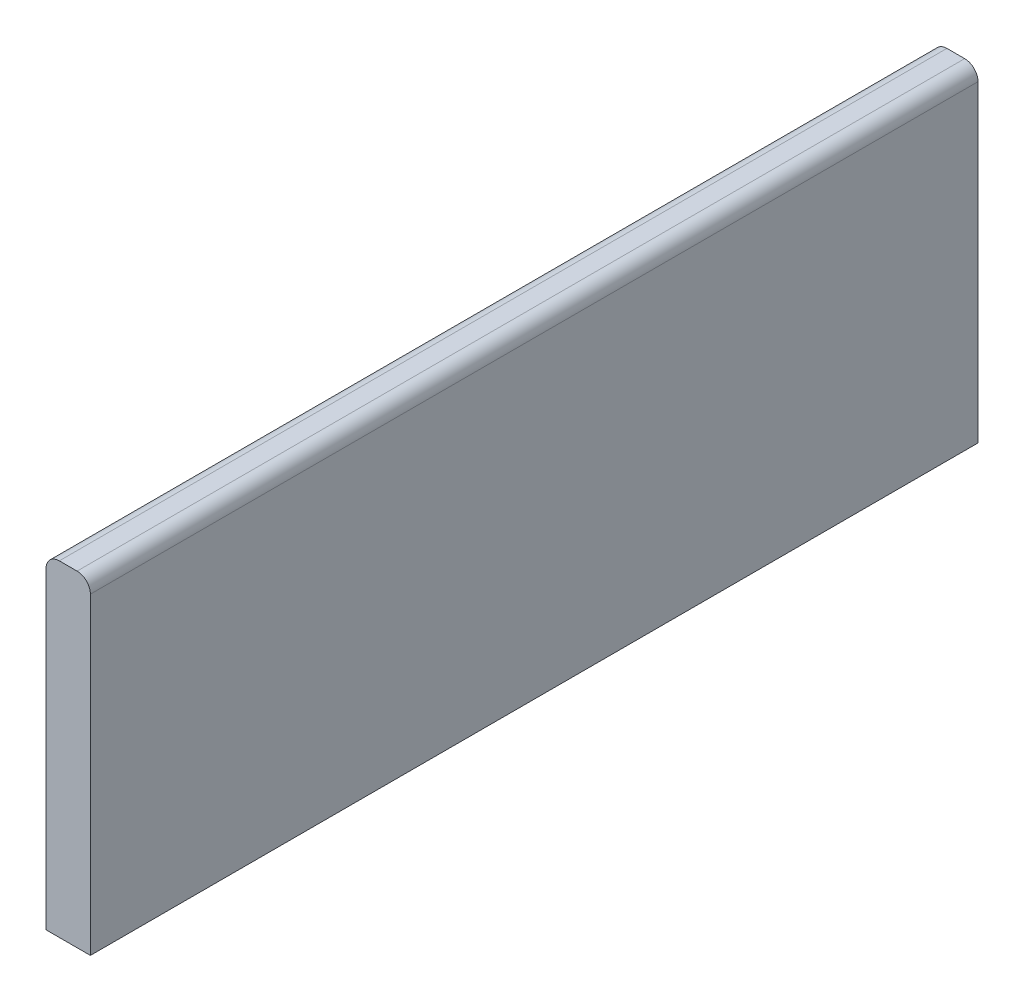
ISO-10303-21;
HEADER;
FILE_DESCRIPTION(('STEP AP214'),'2;1');
FILE_NAME('part.step','',(''),(''),'','','');
FILE_SCHEMA(('AUTOMOTIVE_DESIGN { 1 0 10303 214 1 1 1 1 }'));
ENDSEC;
DATA;
#1=APPLICATION_CONTEXT('core data for automotive mechanical design processes');
#2=APPLICATION_PROTOCOL_DEFINITION('international standard','automotive_design',2000,#1);
#3=PRODUCT_CONTEXT('',#1,'mechanical');
#4=PRODUCT('Part','Part','',(#3));
#5=PRODUCT_RELATED_PRODUCT_CATEGORY('part','',(#4));
#6=PRODUCT_DEFINITION_FORMATION('','',#4);
#7=PRODUCT_DEFINITION_CONTEXT('part definition',#1,'design');
#8=PRODUCT_DEFINITION('design','',#6,#7);
#9=PRODUCT_DEFINITION_SHAPE('','',#8);
#10=(LENGTH_UNIT() NAMED_UNIT(*) SI_UNIT(.MILLI.,.METRE.));
#11=(NAMED_UNIT(*) PLANE_ANGLE_UNIT() SI_UNIT($,.RADIAN.));
#12=(NAMED_UNIT(*) SI_UNIT($,.STERADIAN.) SOLID_ANGLE_UNIT());
#13=UNCERTAINTY_MEASURE_WITH_UNIT(LENGTH_MEASURE(1.E-05),#10,'distance_accuracy_value','');
#14=(GEOMETRIC_REPRESENTATION_CONTEXT(3) GLOBAL_UNCERTAINTY_ASSIGNED_CONTEXT((#13)) GLOBAL_UNIT_ASSIGNED_CONTEXT((#10,
#11,#12)) REPRESENTATION_CONTEXT('',''));
#15=CARTESIAN_POINT('',(0.,0.,0.));
#16=DIRECTION('',(0.,0.,1.));
#17=DIRECTION('',(1.,0.,0.));
#18=AXIS2_PLACEMENT_3D('',#15,#16,#17);
#19=CARTESIAN_POINT('',(104.,0.,200.));
#20=DIRECTION('',(0.,1.,0.));
#21=DIRECTION('',(0.,0.,1.));
#22=AXIS2_PLACEMENT_3D('',#19,#20,#21);
#23=PLANE('',#22);
#24=DIRECTION('',(1.,0.,0.));
#25=VECTOR('',#24,1.);
#26=CARTESIAN_POINT('',(104.,0.,200.));
#27=LINE('',#26,#25);
#28=CARTESIAN_POINT('',(107.,0.,200.));
#29=VERTEX_POINT('',#28);
#30=CARTESIAN_POINT('',(111.,0.,200.));
#31=VERTEX_POINT('',#30);
#32=EDGE_CURVE('E95',#29,#31,#27,.T.);
#33=ORIENTED_EDGE('',*,*,#32,.T.);
#34=DIRECTION('',(0.,0.,-1.));
#35=VECTOR('',#34,1.);
#36=CARTESIAN_POINT('',(111.,0.,200.));
#37=LINE('',#36,#35);
#38=CARTESIAN_POINT('',(111.,0.,0.));
#39=VERTEX_POINT('',#38);
#40=EDGE_CURVE('E115',#31,#39,#37,.T.);
#41=ORIENTED_EDGE('',*,*,#40,.T.);
#42=DIRECTION('',(1.,0.,0.));
#43=VECTOR('',#42,1.);
#44=CARTESIAN_POINT('',(104.,0.,0.));
#45=LINE('',#44,#43);
#46=CARTESIAN_POINT('',(107.,0.,0.));
#47=VERTEX_POINT('',#46);
#48=EDGE_CURVE('E136',#47,#39,#45,.T.);
#49=ORIENTED_EDGE('',*,*,#48,.F.);
#50=DIRECTION('',(0.,0.,-1.));
#51=VECTOR('',#50,1.);
#52=CARTESIAN_POINT('',(107.,0.,200.));
#53=LINE('',#52,#51);
#54=EDGE_CURVE('E109',#47,#29,#53,.F.);
#55=ORIENTED_EDGE('',*,*,#54,.T.);
#56=EDGE_LOOP('',(#33,#41,#49,#55));
#57=FACE_BOUND('',#56,.T.);
#58=ADVANCED_FACE('F34',(#57),#23,.T.);
#59=CARTESIAN_POINT('',(104.,0.,200.));
#60=DIRECTION('',(1.,0.,0.));
#61=DIRECTION('',(0.,1.,0.));
#62=AXIS2_PLACEMENT_3D('',#59,#60,#61);
#63=PLANE('',#62);
#64=DIRECTION('',(0.,-1.,0.));
#65=VECTOR('',#64,1.);
#66=CARTESIAN_POINT('',(104.,0.,200.));
#67=LINE('',#66,#65);
#68=CARTESIAN_POINT('',(104.,-2.99999999999998,200.));
#69=VERTEX_POINT('',#68);
#70=CARTESIAN_POINT('',(104.,-73.5000000000002,200.));
#71=VERTEX_POINT('',#70);
#72=EDGE_CURVE('E99',#69,#71,#67,.T.);
#73=ORIENTED_EDGE('',*,*,#72,.F.);
#74=DIRECTION('',(0.,0.,-1.));
#75=VECTOR('',#74,1.);
#76=CARTESIAN_POINT('',(104.,-2.99999999999998,0.));
#77=LINE('',#76,#75);
#78=CARTESIAN_POINT('',(104.,-2.99999999999998,0.));
#79=VERTEX_POINT('',#78);
#80=EDGE_CURVE('E11',#69,#79,#77,.T.);
#81=ORIENTED_EDGE('',*,*,#80,.T.);
#82=DIRECTION('',(0.,-1.,0.));
#83=VECTOR('',#82,1.);
#84=CARTESIAN_POINT('',(104.,0.,0.));
#85=LINE('',#84,#83);
#86=CARTESIAN_POINT('',(104.,-73.5000000000002,0.));
#87=VERTEX_POINT('',#86);
#88=EDGE_CURVE('E130',#79,#87,#85,.T.);
#89=ORIENTED_EDGE('',*,*,#88,.T.);
#90=DIRECTION('',(0.,0.,-1.));
#91=VECTOR('',#90,1.);
#92=CARTESIAN_POINT('',(104.,-73.5000000000002,200.));
#93=LINE('',#92,#91);
#94=EDGE_CURVE('E107',#71,#87,#93,.T.);
#95=ORIENTED_EDGE('',*,*,#94,.F.);
#96=EDGE_LOOP('',(#73,#81,#89,#95));
#97=FACE_BOUND('',#96,.T.);
#98=ADVANCED_FACE('F142',(#97),#63,.F.);
#99=CARTESIAN_POINT('',(104.,-73.5000000000002,200.));
#100=DIRECTION('',(0.,1.,0.));
#101=DIRECTION('',(0.,0.,1.));
#102=AXIS2_PLACEMENT_3D('',#99,#100,#101);
#103=PLANE('',#102);
#104=DIRECTION('',(1.,0.,0.));
#105=VECTOR('',#104,1.);
#106=CARTESIAN_POINT('',(104.,-73.5000000000002,0.));
#107=LINE('',#106,#105);
#108=CARTESIAN_POINT('',(114.,-73.5000000000002,0.));
#109=VERTEX_POINT('',#108);
#110=EDGE_CURVE('E106',#87,#109,#107,.T.);
#111=ORIENTED_EDGE('',*,*,#110,.T.);
#112=DIRECTION('',(0.,0.,-1.));
#113=VECTOR('',#112,1.);
#114=CARTESIAN_POINT('',(114.,-73.5000000000002,200.));
#115=LINE('',#114,#113);
#116=CARTESIAN_POINT('',(114.,-73.5000000000002,200.));
#117=VERTEX_POINT('',#116);
#118=EDGE_CURVE('E91',#117,#109,#115,.T.);
#119=ORIENTED_EDGE('',*,*,#118,.F.);
#120=DIRECTION('',(1.,0.,0.));
#121=VECTOR('',#120,1.);
#122=CARTESIAN_POINT('',(104.,-73.5000000000002,200.));
#123=LINE('',#122,#121);
#124=EDGE_CURVE('E94',#71,#117,#123,.T.);
#125=ORIENTED_EDGE('',*,*,#124,.F.);
#126=ORIENTED_EDGE('',*,*,#94,.T.);
#127=EDGE_LOOP('',(#111,#119,#125,#126));
#128=FACE_BOUND('',#127,.T.);
#129=ADVANCED_FACE('F104',(#128),#103,.F.);
#130=CARTESIAN_POINT('',(114.,0.,200.));
#131=DIRECTION('',(1.,0.,0.));
#132=DIRECTION('',(0.,0.,-1.));
#133=AXIS2_PLACEMENT_3D('',#130,#131,#132);
#134=PLANE('',#133);
#135=DIRECTION('',(0.,-1.,0.));
#136=VECTOR('',#135,1.);
#137=CARTESIAN_POINT('',(114.,0.,0.));
#138=LINE('',#137,#136);
#139=CARTESIAN_POINT('',(114.,-2.99999999999998,0.));
#140=VERTEX_POINT('',#139);
#141=EDGE_CURVE('E135',#140,#109,#138,.T.);
#142=ORIENTED_EDGE('',*,*,#141,.F.);
#143=DIRECTION('',(0.,0.,-1.));
#144=VECTOR('',#143,1.);
#145=CARTESIAN_POINT('',(114.,-2.99999999999998,200.));
#146=LINE('',#145,#144);
#147=CARTESIAN_POINT('',(114.,-2.99999999999998,200.));
#148=VERTEX_POINT('',#147);
#149=EDGE_CURVE('E57',#140,#148,#146,.F.);
#150=ORIENTED_EDGE('',*,*,#149,.T.);
#151=DIRECTION('',(0.,-1.,0.));
#152=VECTOR('',#151,1.);
#153=CARTESIAN_POINT('',(114.,0.,200.));
#154=LINE('',#153,#152);
#155=EDGE_CURVE('E87',#148,#117,#154,.T.);
#156=ORIENTED_EDGE('',*,*,#155,.T.);
#157=ORIENTED_EDGE('',*,*,#118,.T.);
#158=EDGE_LOOP('',(#142,#150,#156,#157));
#159=FACE_BOUND('',#158,.T.);
#160=ADVANCED_FACE('F89',(#159),#134,.T.);
#161=CARTESIAN_POINT('',(0.,0.,200.));
#162=DIRECTION('',(0.,0.,-1.));
#163=DIRECTION('',(-1.,0.,0.));
#164=AXIS2_PLACEMENT_3D('',#161,#162,#163);
#165=PLANE('',#164);
#166=ORIENTED_EDGE('',*,*,#155,.F.);
#167=CARTESIAN_POINT('',(111.,-2.99999999999998,200.));
#168=DIRECTION('',(0.,0.,-1.));
#169=DIRECTION('',(-1.,0.,0.));
#170=AXIS2_PLACEMENT_3D('',#167,#168,#169);
#171=CIRCLE('',#170,3.);
#172=EDGE_CURVE('E42',#148,#31,#171,.F.);
#173=ORIENTED_EDGE('',*,*,#172,.T.);
#174=ORIENTED_EDGE('',*,*,#32,.F.);
#175=CARTESIAN_POINT('',(107.,-2.99999999999998,200.));
#176=DIRECTION('',(0.,0.,-1.));
#177=DIRECTION('',(-1.,0.,0.));
#178=AXIS2_PLACEMENT_3D('',#175,#176,#177);
#179=CIRCLE('',#178,3.);
#180=EDGE_CURVE('E49',#29,#69,#179,.F.);
#181=ORIENTED_EDGE('',*,*,#180,.T.);
#182=ORIENTED_EDGE('',*,*,#72,.T.);
#183=ORIENTED_EDGE('',*,*,#124,.T.);
#184=EDGE_LOOP('',(#166,#173,#174,#181,#182,#183));
#185=FACE_BOUND('',#184,.T.);
#186=ADVANCED_FACE('F98',(#185),#165,.F.);
#187=CARTESIAN_POINT('',(0.,0.,0.));
#188=DIRECTION('',(0.,0.,-1.));
#189=DIRECTION('',(-1.,0.,0.));
#190=AXIS2_PLACEMENT_3D('',#187,#188,#189);
#191=PLANE('',#190);
#192=ORIENTED_EDGE('',*,*,#48,.T.);
#193=CARTESIAN_POINT('',(111.,-2.99999999999998,0.));
#194=DIRECTION('',(0.,0.,-1.));
#195=DIRECTION('',(-1.,0.,0.));
#196=AXIS2_PLACEMENT_3D('',#193,#194,#195);
#197=CIRCLE('',#196,3.);
#198=EDGE_CURVE('E120',#39,#140,#197,.T.);
#199=ORIENTED_EDGE('',*,*,#198,.T.);
#200=ORIENTED_EDGE('',*,*,#141,.T.);
#201=ORIENTED_EDGE('',*,*,#110,.F.);
#202=ORIENTED_EDGE('',*,*,#88,.F.);
#203=CARTESIAN_POINT('',(107.,-2.99999999999998,0.));
#204=DIRECTION('',(0.,0.,-1.));
#205=DIRECTION('',(-1.,0.,0.));
#206=AXIS2_PLACEMENT_3D('',#203,#204,#205);
#207=CIRCLE('',#206,3.);
#208=EDGE_CURVE('E118',#79,#47,#207,.T.);
#209=ORIENTED_EDGE('',*,*,#208,.T.);
#210=EDGE_LOOP('',(#192,#199,#200,#201,#202,#209));
#211=FACE_BOUND('',#210,.T.);
#212=ADVANCED_FACE('F134',(#211),#191,.T.);
#213=CARTESIAN_POINT('',(111.,-2.99999999999998,200.));
#214=DIRECTION('',(0.,0.,-1.));
#215=DIRECTION('',(-1.,0.,0.));
#216=AXIS2_PLACEMENT_3D('',#213,#214,#215);
#217=CYLINDRICAL_SURFACE('',#216,3.);
#218=ORIENTED_EDGE('',*,*,#172,.F.);
#219=ORIENTED_EDGE('',*,*,#149,.F.);
#220=ORIENTED_EDGE('',*,*,#198,.F.);
#221=ORIENTED_EDGE('',*,*,#40,.F.);
#222=EDGE_LOOP('',(#218,#219,#220,#221));
#223=FACE_BOUND('',#222,.T.);
#224=ADVANCED_FACE('F132',(#223),#217,.T.);
#225=CARTESIAN_POINT('',(107.,-2.99999999999998,200.));
#226=DIRECTION('',(0.,0.,1.));
#227=DIRECTION('',(1.,0.,0.));
#228=AXIS2_PLACEMENT_3D('',#225,#226,#227);
#229=CYLINDRICAL_SURFACE('',#228,3.);
#230=ORIENTED_EDGE('',*,*,#180,.F.);
#231=ORIENTED_EDGE('',*,*,#54,.F.);
#232=ORIENTED_EDGE('',*,*,#208,.F.);
#233=ORIENTED_EDGE('',*,*,#80,.F.);
#234=EDGE_LOOP('',(#230,#231,#232,#233));
#235=FACE_BOUND('',#234,.T.);
#236=ADVANCED_FACE('F36',(#235),#229,.T.);
#237=CLOSED_SHELL('',(#58,#98,#129,#160,#186,#212,#224,#236));
#238=MANIFOLD_SOLID_BREP('B2',#237);
#239=ADVANCED_BREP_SHAPE_REPRESENTATION('',(#18,#238),#14);
#240=SHAPE_DEFINITION_REPRESENTATION(#9,#239);
ENDSEC;
END-ISO-10303-21;
